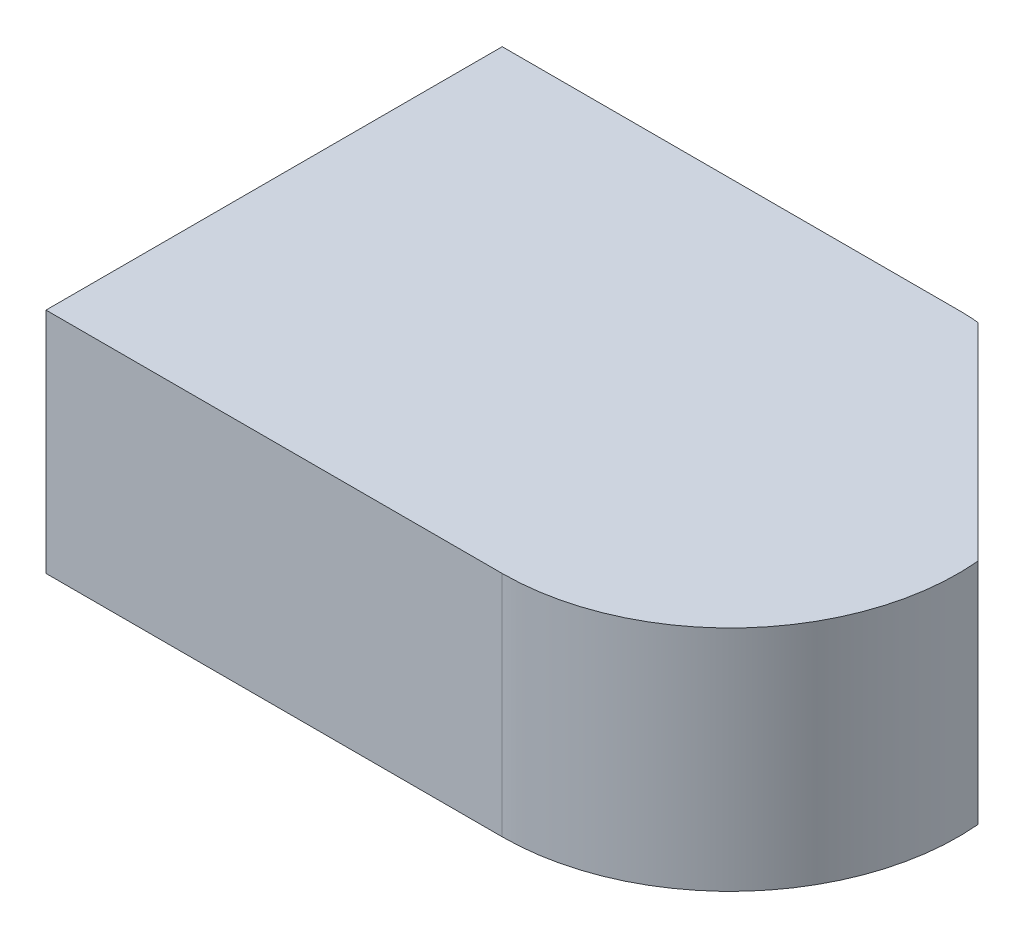
ISO-10303-21;
HEADER;
FILE_DESCRIPTION(('STEP AP214'),'2;1');
FILE_NAME('part.step','',(''),(''),'','','');
FILE_SCHEMA(('AUTOMOTIVE_DESIGN { 1 0 10303 214 1 1 1 1 }'));
ENDSEC;
DATA;
#1=APPLICATION_CONTEXT('core data for automotive mechanical design processes');
#2=APPLICATION_PROTOCOL_DEFINITION('international standard','automotive_design',2000,#1);
#3=PRODUCT_CONTEXT('',#1,'mechanical');
#4=PRODUCT('Part','Part','',(#3));
#5=PRODUCT_RELATED_PRODUCT_CATEGORY('part','',(#4));
#6=PRODUCT_DEFINITION_FORMATION('','',#4);
#7=PRODUCT_DEFINITION_CONTEXT('part definition',#1,'design');
#8=PRODUCT_DEFINITION('design','',#6,#7);
#9=PRODUCT_DEFINITION_SHAPE('','',#8);
#10=(LENGTH_UNIT() NAMED_UNIT(*) SI_UNIT(.MILLI.,.METRE.));
#11=(NAMED_UNIT(*) PLANE_ANGLE_UNIT() SI_UNIT($,.RADIAN.));
#12=(NAMED_UNIT(*) SI_UNIT($,.STERADIAN.) SOLID_ANGLE_UNIT());
#13=UNCERTAINTY_MEASURE_WITH_UNIT(LENGTH_MEASURE(1.E-05),#10,'distance_accuracy_value','');
#14=(GEOMETRIC_REPRESENTATION_CONTEXT(3) GLOBAL_UNCERTAINTY_ASSIGNED_CONTEXT((#13)) GLOBAL_UNIT_ASSIGNED_CONTEXT((#10,
#11,#12)) REPRESENTATION_CONTEXT('',''));
#15=CARTESIAN_POINT('',(0.,0.,0.));
#16=DIRECTION('',(0.,0.,1.));
#17=DIRECTION('',(1.,0.,0.));
#18=AXIS2_PLACEMENT_3D('',#15,#16,#17);
#19=CARTESIAN_POINT('',(0.,0.,0.));
#20=DIRECTION('',(0.,-1.,0.));
#21=DIRECTION('',(-1.,0.,0.));
#22=AXIS2_PLACEMENT_3D('',#19,#20,#21);
#23=PLANE('',#22);
#24=CARTESIAN_POINT('',(-1.05,0.,-1.8));
#25=DIRECTION('',(0.,-1.,0.));
#26=DIRECTION('',(0.995957180044504,0.,-0.0898292575823653));
#27=AXIS2_PLACEMENT_3D('',#24,#25,#26);
#28=CIRCLE('',#27,0.1);
#29=CARTESIAN_POINT('',(-0.950404281995,0.,-1.808982925758));
#30=VERTEX_POINT('',#29);
#31=CARTESIAN_POINT('',(-1.05,0.,-1.7));
#32=VERTEX_POINT('',#31);
#33=EDGE_CURVE('E11',#30,#32,#28,.T.);
#34=ORIENTED_EDGE('',*,*,#33,.T.);
#35=DIRECTION('',(-1.,0.,0.));
#36=VECTOR('',#35,1.);
#37=CARTESIAN_POINT('',(-1.05,0.,-1.7));
#38=LINE('',#37,#36);
#39=CARTESIAN_POINT('',(-1.25,0.,-1.7));
#40=VERTEX_POINT('',#39);
#41=EDGE_CURVE('E25',#32,#40,#38,.T.);
#42=ORIENTED_EDGE('',*,*,#41,.T.);
#43=DIRECTION('',(0.,0.,-1.));
#44=VECTOR('',#43,1.);
#45=CARTESIAN_POINT('',(-1.25,0.,-1.7));
#46=LINE('',#45,#44);
#47=CARTESIAN_POINT('',(-1.25,0.,-1.9));
#48=VERTEX_POINT('',#47);
#49=EDGE_CURVE('E144',#40,#48,#46,.T.);
#50=ORIENTED_EDGE('',*,*,#49,.T.);
#51=DIRECTION('',(1.,0.,0.));
#52=VECTOR('',#51,1.);
#53=CARTESIAN_POINT('',(-1.25,0.,-1.9));
#54=LINE('',#53,#52);
#55=CARTESIAN_POINT('',(-1.05,0.,-1.9));
#56=VERTEX_POINT('',#55);
#57=EDGE_CURVE('E140',#48,#56,#54,.T.);
#58=ORIENTED_EDGE('',*,*,#57,.T.);
#59=CARTESIAN_POINT('',(-1.05,0.,-1.8));
#60=DIRECTION('',(0.,-1.,0.));
#61=DIRECTION('',(0.,0.,-1.));
#62=AXIS2_PLACEMENT_3D('',#59,#60,#61);
#63=CIRCLE('',#62,0.1);
#64=CARTESIAN_POINT('',(-1.041017074242,0.,-1.899595718004));
#65=VERTEX_POINT('',#64);
#66=EDGE_CURVE('E88',#56,#65,#63,.T.);
#67=ORIENTED_EDGE('',*,*,#66,.T.);
#68=DIRECTION('',(-0.707106781186548,0.,-0.707106781186548));
#69=VECTOR('',#68,1.);
#70=CARTESIAN_POINT('',(-0.950404281995,0.,-1.808982925758));
#71=LINE('',#70,#69);
#72=EDGE_CURVE('E132',#30,#65,#71,.T.);
#73=ORIENTED_EDGE('',*,*,#72,.F.);
#74=EDGE_LOOP('',(#34,#42,#50,#58,#67,#73));
#75=FACE_BOUND('',#74,.T.);
#76=ADVANCED_FACE('F17',(#75),#23,.T.);
#77=CARTESIAN_POINT('',(-0.950404281995,-0.02,-1.808982925758));
#78=DIRECTION('',(0.707106781186548,0.,-0.707106781186548));
#79=DIRECTION('',(-0.707106781186548,0.,-0.707106781186548));
#80=AXIS2_PLACEMENT_3D('',#77,#78,#79);
#81=PLANE('',#80);
#82=DIRECTION('',(0.,-1.,0.));
#83=VECTOR('',#82,1.);
#84=CARTESIAN_POINT('',(-1.041017074242,0.1,-1.899595718004));
#85=LINE('',#84,#83);
#86=CARTESIAN_POINT('',(-1.041017074242,0.1,-1.899595718004));
#87=VERTEX_POINT('',#86);
#88=EDGE_CURVE('E128',#87,#65,#85,.T.);
#89=ORIENTED_EDGE('',*,*,#88,.F.);
#90=DIRECTION('',(-0.707106781186548,0.,-0.707106781186548));
#91=VECTOR('',#90,1.);
#92=CARTESIAN_POINT('',(-0.950404281995,0.1,-1.808982925758));
#93=LINE('',#92,#91);
#94=CARTESIAN_POINT('',(-0.950404281995,0.1,-1.808982925758));
#95=VERTEX_POINT('',#94);
#96=EDGE_CURVE('E83',#95,#87,#93,.T.);
#97=ORIENTED_EDGE('',*,*,#96,.F.);
#98=DIRECTION('',(0.,-1.,0.));
#99=VECTOR('',#98,1.);
#100=CARTESIAN_POINT('',(-0.950404281995,0.1,-1.808982925758));
#101=LINE('',#100,#99);
#102=EDGE_CURVE('E120',#95,#30,#101,.T.);
#103=ORIENTED_EDGE('',*,*,#102,.T.);
#104=ORIENTED_EDGE('',*,*,#72,.T.);
#105=EDGE_LOOP('',(#89,#97,#103,#104));
#106=FACE_BOUND('',#105,.T.);
#107=ADVANCED_FACE('F163',(#106),#81,.T.);
#108=CARTESIAN_POINT('',(-1.05,0.,-1.8));
#109=DIRECTION('',(0.,-1.,0.));
#110=DIRECTION('',(-0.73818333006861,0.,-0.674600156543724));
#111=AXIS2_PLACEMENT_3D('',#108,#109,#110);
#112=CYLINDRICAL_SURFACE('',#111,0.1);
#113=CARTESIAN_POINT('',(-1.05,0.1,-1.8));
#114=DIRECTION('',(0.,-1.,0.));
#115=DIRECTION('',(0.995957180044504,0.,-0.0898292575823653));
#116=AXIS2_PLACEMENT_3D('',#113,#114,#115);
#117=CIRCLE('',#116,0.1);
#118=CARTESIAN_POINT('',(-1.05,0.1,-1.7));
#119=VERTEX_POINT('',#118);
#120=EDGE_CURVE('E116',#95,#119,#117,.T.);
#121=ORIENTED_EDGE('',*,*,#120,.T.);
#122=DIRECTION('',(0.,1.,0.));
#123=VECTOR('',#122,1.);
#124=CARTESIAN_POINT('',(-1.05,0.,-1.7));
#125=LINE('',#124,#123);
#126=EDGE_CURVE('E111',#32,#119,#125,.T.);
#127=ORIENTED_EDGE('',*,*,#126,.F.);
#128=ORIENTED_EDGE('',*,*,#33,.F.);
#129=ORIENTED_EDGE('',*,*,#102,.F.);
#130=EDGE_LOOP('',(#121,#127,#128,#129));
#131=FACE_BOUND('',#130,.T.);
#132=ADVANCED_FACE('F161',(#131),#112,.T.);
#133=CARTESIAN_POINT('',(-1.05,0.,-1.7));
#134=DIRECTION('',(0.,0.,-1.));
#135=DIRECTION('',(-1.,0.,0.));
#136=AXIS2_PLACEMENT_3D('',#133,#134,#135);
#137=PLANE('',#136);
#138=ORIENTED_EDGE('',*,*,#126,.T.);
#139=DIRECTION('',(-1.,0.,0.));
#140=VECTOR('',#139,1.);
#141=CARTESIAN_POINT('',(-1.05,0.1,-1.7));
#142=LINE('',#141,#140);
#143=CARTESIAN_POINT('',(-1.25,0.1,-1.7));
#144=VERTEX_POINT('',#143);
#145=EDGE_CURVE('E107',#119,#144,#142,.T.);
#146=ORIENTED_EDGE('',*,*,#145,.T.);
#147=DIRECTION('',(0.,1.,0.));
#148=VECTOR('',#147,1.);
#149=CARTESIAN_POINT('',(-1.25,0.,-1.7));
#150=LINE('',#149,#148);
#151=EDGE_CURVE('E102',#40,#144,#150,.T.);
#152=ORIENTED_EDGE('',*,*,#151,.F.);
#153=ORIENTED_EDGE('',*,*,#41,.F.);
#154=EDGE_LOOP('',(#138,#146,#152,#153));
#155=FACE_BOUND('',#154,.T.);
#156=ADVANCED_FACE('F159',(#155),#137,.F.);
#157=CARTESIAN_POINT('',(-1.25,0.,-1.7));
#158=DIRECTION('',(1.,0.,0.));
#159=DIRECTION('',(0.,0.,-1.));
#160=AXIS2_PLACEMENT_3D('',#157,#158,#159);
#161=PLANE('',#160);
#162=ORIENTED_EDGE('',*,*,#151,.T.);
#163=DIRECTION('',(0.,0.,-1.));
#164=VECTOR('',#163,1.);
#165=CARTESIAN_POINT('',(-1.25,0.1,-1.7));
#166=LINE('',#165,#164);
#167=CARTESIAN_POINT('',(-1.25,0.1,-1.9));
#168=VERTEX_POINT('',#167);
#169=EDGE_CURVE('E98',#144,#168,#166,.T.);
#170=ORIENTED_EDGE('',*,*,#169,.T.);
#171=DIRECTION('',(0.,1.,0.));
#172=VECTOR('',#171,1.);
#173=CARTESIAN_POINT('',(-1.25,0.,-1.9));
#174=LINE('',#173,#172);
#175=EDGE_CURVE('E74',#48,#168,#174,.T.);
#176=ORIENTED_EDGE('',*,*,#175,.F.);
#177=ORIENTED_EDGE('',*,*,#49,.F.);
#178=EDGE_LOOP('',(#162,#170,#176,#177));
#179=FACE_BOUND('',#178,.T.);
#180=ADVANCED_FACE('F154',(#179),#161,.F.);
#181=CARTESIAN_POINT('',(-1.25,0.,-1.9));
#182=DIRECTION('',(0.,0.,1.));
#183=DIRECTION('',(1.,0.,0.));
#184=AXIS2_PLACEMENT_3D('',#181,#182,#183);
#185=PLANE('',#184);
#186=ORIENTED_EDGE('',*,*,#175,.T.);
#187=DIRECTION('',(1.,0.,0.));
#188=VECTOR('',#187,1.);
#189=CARTESIAN_POINT('',(-1.25,0.1,-1.9));
#190=LINE('',#189,#188);
#191=CARTESIAN_POINT('',(-1.05,0.1,-1.9));
#192=VERTEX_POINT('',#191);
#193=EDGE_CURVE('E66',#168,#192,#190,.T.);
#194=ORIENTED_EDGE('',*,*,#193,.T.);
#195=DIRECTION('',(0.,1.,0.));
#196=VECTOR('',#195,1.);
#197=CARTESIAN_POINT('',(-1.05,0.,-1.9));
#198=LINE('',#197,#196);
#199=EDGE_CURVE('E71',#56,#192,#198,.T.);
#200=ORIENTED_EDGE('',*,*,#199,.F.);
#201=ORIENTED_EDGE('',*,*,#57,.F.);
#202=EDGE_LOOP('',(#186,#194,#200,#201));
#203=FACE_BOUND('',#202,.T.);
#204=ADVANCED_FACE('F68',(#203),#185,.F.);
#205=CARTESIAN_POINT('',(-1.05,0.,-1.8));
#206=DIRECTION('',(0.,-1.,0.));
#207=DIRECTION('',(-0.0449600931678338,0.,0.998988783732));
#208=AXIS2_PLACEMENT_3D('',#205,#206,#207);
#209=CYLINDRICAL_SURFACE('',#208,0.1);
#210=ORIENTED_EDGE('',*,*,#66,.F.);
#211=ORIENTED_EDGE('',*,*,#199,.T.);
#212=CARTESIAN_POINT('',(-1.05,0.1,-1.8));
#213=DIRECTION('',(0.,-1.,0.));
#214=DIRECTION('',(0.,0.,-1.));
#215=AXIS2_PLACEMENT_3D('',#212,#213,#214);
#216=CIRCLE('',#215,0.1);
#217=EDGE_CURVE('E80',#192,#87,#216,.T.);
#218=ORIENTED_EDGE('',*,*,#217,.T.);
#219=ORIENTED_EDGE('',*,*,#88,.T.);
#220=EDGE_LOOP('',(#210,#211,#218,#219));
#221=FACE_BOUND('',#220,.T.);
#222=ADVANCED_FACE('F87',(#221),#209,.T.);
#223=CARTESIAN_POINT('',(0.,0.1,0.));
#224=DIRECTION('',(0.,-1.,0.));
#225=DIRECTION('',(-1.,0.,0.));
#226=AXIS2_PLACEMENT_3D('',#223,#224,#225);
#227=PLANE('',#226);
#228=ORIENTED_EDGE('',*,*,#217,.F.);
#229=ORIENTED_EDGE('',*,*,#193,.F.);
#230=ORIENTED_EDGE('',*,*,#169,.F.);
#231=ORIENTED_EDGE('',*,*,#145,.F.);
#232=ORIENTED_EDGE('',*,*,#120,.F.);
#233=ORIENTED_EDGE('',*,*,#96,.T.);
#234=EDGE_LOOP('',(#228,#229,#230,#231,#232,#233));
#235=FACE_BOUND('',#234,.T.);
#236=ADVANCED_FACE('F81',(#235),#227,.F.);
#237=CLOSED_SHELL('',(#76,#107,#132,#156,#180,#204,#222,#236));
#238=MANIFOLD_SOLID_BREP('B1',#237);
#239=ADVANCED_BREP_SHAPE_REPRESENTATION('',(#18,#238),#14);
#240=SHAPE_DEFINITION_REPRESENTATION(#9,#239);
ENDSEC;
END-ISO-10303-21;
